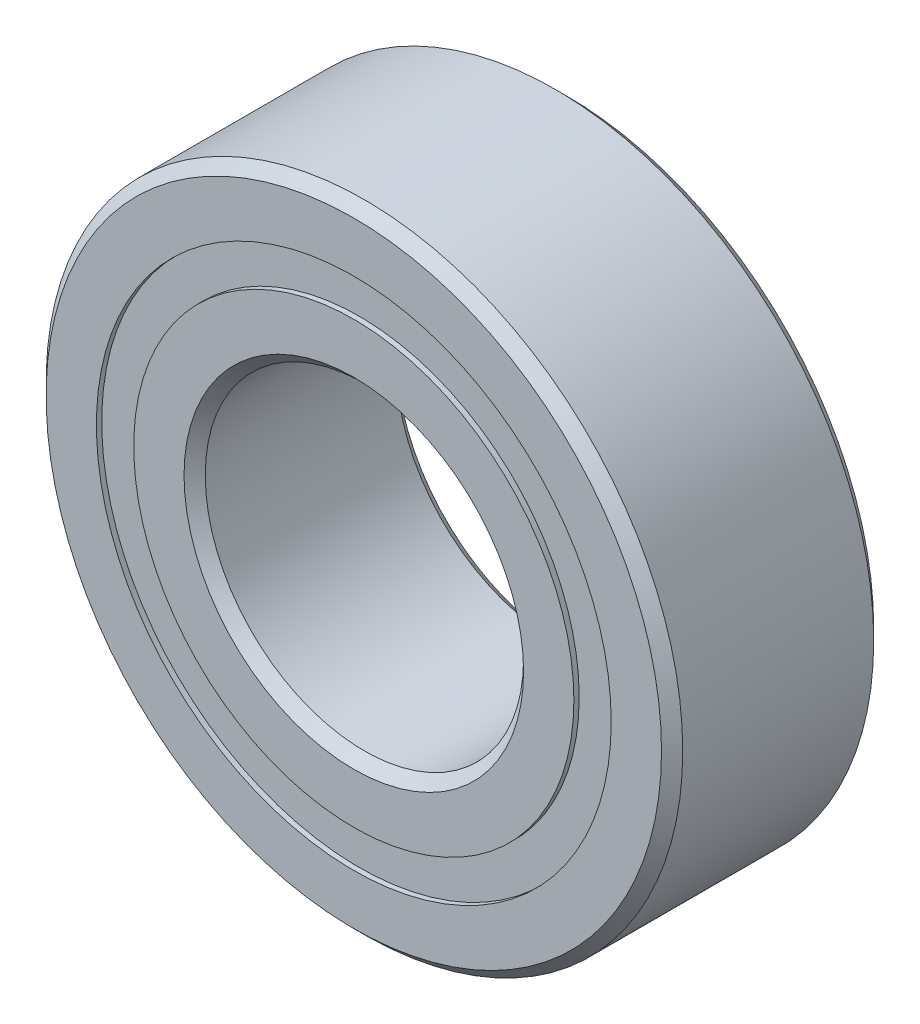
ISO-10303-21;
HEADER;
FILE_DESCRIPTION(('STEP AP214'),'2;1');
FILE_NAME('part.step','',(''),(''),'','','');
FILE_SCHEMA(('AUTOMOTIVE_DESIGN { 1 0 10303 214 1 1 1 1 }'));
ENDSEC;
DATA;
#1=APPLICATION_CONTEXT('core data for automotive mechanical design processes');
#2=APPLICATION_PROTOCOL_DEFINITION('international standard','automotive_design',2000,#1);
#3=PRODUCT_CONTEXT('',#1,'mechanical');
#4=PRODUCT('Part','Part','',(#3));
#5=PRODUCT_RELATED_PRODUCT_CATEGORY('part','',(#4));
#6=PRODUCT_DEFINITION_FORMATION('','',#4);
#7=PRODUCT_DEFINITION_CONTEXT('part definition',#1,'design');
#8=PRODUCT_DEFINITION('design','',#6,#7);
#9=PRODUCT_DEFINITION_SHAPE('','',#8);
#10=(LENGTH_UNIT() NAMED_UNIT(*) SI_UNIT(.MILLI.,.METRE.));
#11=(NAMED_UNIT(*) PLANE_ANGLE_UNIT() SI_UNIT($,.RADIAN.));
#12=(NAMED_UNIT(*) SI_UNIT($,.STERADIAN.) SOLID_ANGLE_UNIT());
#13=UNCERTAINTY_MEASURE_WITH_UNIT(LENGTH_MEASURE(1.E-05),#10,'distance_accuracy_value','');
#14=(GEOMETRIC_REPRESENTATION_CONTEXT(3) GLOBAL_UNCERTAINTY_ASSIGNED_CONTEXT((#13)) GLOBAL_UNIT_ASSIGNED_CONTEXT((#10,
#11,#12)) REPRESENTATION_CONTEXT('',''));
#15=CARTESIAN_POINT('',(0.,0.,0.));
#16=DIRECTION('',(0.,0.,1.));
#17=DIRECTION('',(1.,0.,0.));
#18=AXIS2_PLACEMENT_3D('',#15,#16,#17);
#19=CARTESIAN_POINT('',(0.,4.85164835164835,-1.9));
#20=DIRECTION('',(0.,0.,1.));
#21=DIRECTION('',(1.,0.,0.));
#22=AXIS2_PLACEMENT_3D('',#19,#20,#21);
#23=PLANE('',#22);
#24=CARTESIAN_POINT('',(0.,0.,-1.9));
#25=DIRECTION('',(0.,0.,1.));
#26=DIRECTION('',(1.,0.,0.));
#27=AXIS2_PLACEMENT_3D('',#24,#25,#26);
#28=CIRCLE('',#27,4.85164835164835);
#29=CARTESIAN_POINT('',(4.85164835164835,0.,-1.9));
#30=VERTEX_POINT('',#29);
#31=EDGE_CURVE('E69',#30,#30,#28,.T.);
#32=ORIENTED_EDGE('',*,*,#31,.F.);
#33=EDGE_LOOP('',(#32));
#34=FACE_BOUND('',#33,.T.);
#35=CARTESIAN_POINT('',(0.,0.,-1.9));
#36=DIRECTION('',(0.,0.,1.));
#37=DIRECTION('',(1.,0.,0.));
#38=AXIS2_PLACEMENT_3D('',#35,#36,#37);
#39=CIRCLE('',#38,4.14835164835165);
#40=CARTESIAN_POINT('',(4.14835164835165,0.,-1.9));
#41=VERTEX_POINT('',#40);
#42=EDGE_CURVE('E11',#41,#41,#39,.T.);
#43=ORIENTED_EDGE('',*,*,#42,.T.);
#44=EDGE_LOOP('',(#43));
#45=FACE_BOUND('',#44,.T.);
#46=ADVANCED_FACE('F50',(#34,#45),#23,.F.);
#47=CARTESIAN_POINT('',(0.,0.,2.));
#48=DIRECTION('',(0.,0.,1.));
#49=DIRECTION('',(1.,0.,0.));
#50=AXIS2_PLACEMENT_3D('',#47,#48,#49);
#51=CYLINDRICAL_SURFACE('',#50,4.14835164835165);
#52=ORIENTED_EDGE('',*,*,#42,.F.);
#53=EDGE_LOOP('',(#52));
#54=FACE_BOUND('',#53,.T.);
#55=CARTESIAN_POINT('',(0.,0.,-0.955918417024762));
#56=DIRECTION('',(0.,0.,1.));
#57=DIRECTION('',(1.,0.,0.));
#58=AXIS2_PLACEMENT_3D('',#55,#56,#57);
#59=CIRCLE('',#58,4.14835164835165);
#60=CARTESIAN_POINT('',(4.14835164835165,0.,-0.955918417024762));
#61=VERTEX_POINT('',#60);
#62=EDGE_CURVE('E57',#61,#61,#59,.T.);
#63=ORIENTED_EDGE('',*,*,#62,.T.);
#64=EDGE_LOOP('',(#63));
#65=FACE_BOUND('',#64,.T.);
#66=ADVANCED_FACE('F80',(#54,#65),#51,.F.);
#67=CARTESIAN_POINT('',(0.,4.85164835164835,-0.955918417024762));
#68=DIRECTION('',(0.,0.,-1.));
#69=DIRECTION('',(-1.,0.,0.));
#70=AXIS2_PLACEMENT_3D('',#67,#68,#69);
#71=PLANE('',#70);
#72=ORIENTED_EDGE('',*,*,#62,.F.);
#73=EDGE_LOOP('',(#72));
#74=FACE_BOUND('',#73,.T.);
#75=CARTESIAN_POINT('',(0.,0.,-0.955918417024762));
#76=DIRECTION('',(0.,0.,1.));
#77=DIRECTION('',(1.,0.,0.));
#78=AXIS2_PLACEMENT_3D('',#75,#76,#77);
#79=CIRCLE('',#78,4.85164835164835);
#80=CARTESIAN_POINT('',(4.85164835164835,0.,-0.955918417024762));
#81=VERTEX_POINT('',#80);
#82=EDGE_CURVE('E63',#81,#81,#79,.T.);
#83=ORIENTED_EDGE('',*,*,#82,.T.);
#84=EDGE_LOOP('',(#83));
#85=FACE_BOUND('',#84,.T.);
#86=ADVANCED_FACE('F84',(#74,#85),#71,.F.);
#87=CARTESIAN_POINT('',(0.,0.,2.));
#88=DIRECTION('',(0.,0.,1.));
#89=DIRECTION('',(1.,0.,0.));
#90=AXIS2_PLACEMENT_3D('',#87,#88,#89);
#91=CYLINDRICAL_SURFACE('',#90,4.85164835164835);
#92=ORIENTED_EDGE('',*,*,#82,.F.);
#93=EDGE_LOOP('',(#92));
#94=FACE_BOUND('',#93,.T.);
#95=ORIENTED_EDGE('',*,*,#31,.T.);
#96=EDGE_LOOP('',(#95));
#97=FACE_BOUND('',#96,.T.);
#98=ADVANCED_FACE('F77',(#94,#97),#91,.T.);
#99=CLOSED_SHELL('',(#46,#66,#86,#98));
#100=MANIFOLD_SOLID_BREP('B2',#99);
#101=CARTESIAN_POINT('',(0.,4.85164835164835,1.9));
#102=DIRECTION('',(0.,0.,-1.));
#103=DIRECTION('',(-1.,0.,0.));
#104=AXIS2_PLACEMENT_3D('',#101,#102,#103);
#105=PLANE('',#104);
#106=CARTESIAN_POINT('',(0.,0.,1.9));
#107=DIRECTION('',(0.,0.,1.));
#108=DIRECTION('',(1.,0.,0.));
#109=AXIS2_PLACEMENT_3D('',#106,#107,#108);
#110=CIRCLE('',#109,4.14835164835165);
#111=CARTESIAN_POINT('',(4.14835164835165,0.,1.9));
#112=VERTEX_POINT('',#111);
#113=EDGE_CURVE('E49',#112,#112,#110,.T.);
#114=ORIENTED_EDGE('',*,*,#113,.F.);
#115=EDGE_LOOP('',(#114));
#116=FACE_BOUND('',#115,.T.);
#117=CARTESIAN_POINT('',(0.,0.,1.9));
#118=DIRECTION('',(0.,0.,1.));
#119=DIRECTION('',(1.,0.,0.));
#120=AXIS2_PLACEMENT_3D('',#117,#118,#119);
#121=CIRCLE('',#120,4.85164835164835);
#122=CARTESIAN_POINT('',(4.85164835164835,0.,1.9));
#123=VERTEX_POINT('',#122);
#124=EDGE_CURVE('E145',#123,#123,#121,.T.);
#125=ORIENTED_EDGE('',*,*,#124,.T.);
#126=EDGE_LOOP('',(#125));
#127=FACE_BOUND('',#126,.T.);
#128=ADVANCED_FACE('F126',(#116,#127),#105,.F.);
#129=CARTESIAN_POINT('',(0.,0.,2.));
#130=DIRECTION('',(0.,0.,1.));
#131=DIRECTION('',(1.,0.,0.));
#132=AXIS2_PLACEMENT_3D('',#129,#130,#131);
#133=CYLINDRICAL_SURFACE('',#132,4.14835164835165);
#134=CARTESIAN_POINT('',(0.,0.,0.955918417024761));
#135=DIRECTION('',(0.,0.,1.));
#136=DIRECTION('',(1.,0.,0.));
#137=AXIS2_PLACEMENT_3D('',#134,#135,#136);
#138=CIRCLE('',#137,4.14835164835165);
#139=CARTESIAN_POINT('',(4.14835164835165,0.,0.955918417024761));
#140=VERTEX_POINT('',#139);
#141=EDGE_CURVE('E133',#140,#140,#138,.T.);
#142=ORIENTED_EDGE('',*,*,#141,.F.);
#143=EDGE_LOOP('',(#142));
#144=FACE_BOUND('',#143,.T.);
#145=ORIENTED_EDGE('',*,*,#113,.T.);
#146=EDGE_LOOP('',(#145));
#147=FACE_BOUND('',#146,.T.);
#148=ADVANCED_FACE('F162',(#144,#147),#133,.F.);
#149=CARTESIAN_POINT('',(0.,4.85164835164835,0.955918417024761));
#150=DIRECTION('',(0.,0.,1.));
#151=DIRECTION('',(1.,0.,0.));
#152=AXIS2_PLACEMENT_3D('',#149,#150,#151);
#153=PLANE('',#152);
#154=CARTESIAN_POINT('',(0.,0.,0.955918417024761));
#155=DIRECTION('',(0.,0.,1.));
#156=DIRECTION('',(1.,0.,0.));
#157=AXIS2_PLACEMENT_3D('',#154,#155,#156);
#158=CIRCLE('',#157,4.85164835164835);
#159=CARTESIAN_POINT('',(4.85164835164835,0.,0.955918417024761));
#160=VERTEX_POINT('',#159);
#161=EDGE_CURVE('E139',#160,#160,#158,.T.);
#162=ORIENTED_EDGE('',*,*,#161,.F.);
#163=EDGE_LOOP('',(#162));
#164=FACE_BOUND('',#163,.T.);
#165=ORIENTED_EDGE('',*,*,#141,.T.);
#166=EDGE_LOOP('',(#165));
#167=FACE_BOUND('',#166,.T.);
#168=ADVANCED_FACE('F157',(#164,#167),#153,.F.);
#169=CARTESIAN_POINT('',(0.,0.,2.));
#170=DIRECTION('',(0.,0.,1.));
#171=DIRECTION('',(1.,0.,0.));
#172=AXIS2_PLACEMENT_3D('',#169,#170,#171);
#173=CYLINDRICAL_SURFACE('',#172,4.85164835164835);
#174=ORIENTED_EDGE('',*,*,#124,.F.);
#175=EDGE_LOOP('',(#174));
#176=FACE_BOUND('',#175,.T.);
#177=ORIENTED_EDGE('',*,*,#161,.T.);
#178=EDGE_LOOP('',(#177));
#179=FACE_BOUND('',#178,.T.);
#180=ADVANCED_FACE('F154',(#176,#179),#173,.T.);
#181=CLOSED_SHELL('',(#128,#148,#168,#180));
#182=MANIFOLD_SOLID_BREP('B6',#181);
#183=CARTESIAN_POINT('',(-2.24999999999995,3.89711431703,0.));
#184=DIRECTION('',(0.,0.,1.));
#185=DIRECTION('',(-0.499999999999989,0.866025403784445,0.));
#186=AXIS2_PLACEMENT_3D('',#183,#184,#185);
#187=SPHERICAL_SURFACE('',#186,0.955918417024761);
#188=CARTESIAN_POINT('',(-2.24999999999995,3.89711431703,0.955918417024761));
#189=VERTEX_POINT('',#188);
#190=VERTEX_LOOP('',#189);
#191=FACE_BOUND('',#190,.T.);
#192=ADVANCED_FACE('F202',(#191),#187,.T.);
#193=CLOSED_SHELL('',(#192));
#194=MANIFOLD_SOLID_BREP('B44',#193);
#195=CARTESIAN_POINT('',(-3.89711431702995,2.25000000000005,0.));
#196=DIRECTION('',(0.,0.,1.));
#197=DIRECTION('',(-0.866025403784433,0.50000000000001,0.));
#198=AXIS2_PLACEMENT_3D('',#195,#196,#197);
#199=SPHERICAL_SURFACE('',#198,0.955918417024761);
#200=CARTESIAN_POINT('',(-3.89711431702995,2.25000000000005,0.955918417024761));
#201=VERTEX_POINT('',#200);
#202=VERTEX_LOOP('',#201);
#203=FACE_BOUND('',#202,.T.);
#204=ADVANCED_FACE('F223',(#203),#199,.T.);
#205=CLOSED_SHELL('',(#204));
#206=MANIFOLD_SOLID_BREP('B122',#205);
#207=CARTESIAN_POINT('',(-4.5,0.,0.));
#208=DIRECTION('',(0.,0.,1.));
#209=DIRECTION('',(-1.,0.,0.));
#210=AXIS2_PLACEMENT_3D('',#207,#208,#209);
#211=SPHERICAL_SURFACE('',#210,0.955918417024761);
#212=CARTESIAN_POINT('',(-4.5,0.,0.955918417024761));
#213=VERTEX_POINT('',#212);
#214=VERTEX_LOOP('',#213);
#215=FACE_BOUND('',#214,.T.);
#216=ADVANCED_FACE('F244',(#215),#211,.T.);
#217=CLOSED_SHELL('',(#216));
#218=MANIFOLD_SOLID_BREP('B198',#217);
#219=CARTESIAN_POINT('',(-3.89711431703,-2.24999999999996,0.));
#220=DIRECTION('',(0.,0.,1.));
#221=DIRECTION('',(-0.866025403784443,-0.499999999999992,0.));
#222=AXIS2_PLACEMENT_3D('',#219,#220,#221);
#223=SPHERICAL_SURFACE('',#222,0.955918417024761);
#224=CARTESIAN_POINT('',(-3.89711431703,-2.24999999999996,0.955918417024761));
#225=VERTEX_POINT('',#224);
#226=VERTEX_LOOP('',#225);
#227=FACE_BOUND('',#226,.T.);
#228=ADVANCED_FACE('F265',(#227),#223,.T.);
#229=CLOSED_SHELL('',(#228));
#230=MANIFOLD_SOLID_BREP('B219',#229);
#231=CARTESIAN_POINT('',(-2.25000000000003,-3.89711431702996,0.));
#232=DIRECTION('',(0.,0.,1.));
#233=DIRECTION('',(-0.500000000000007,-0.866025403784435,0.));
#234=AXIS2_PLACEMENT_3D('',#231,#232,#233);
#235=SPHERICAL_SURFACE('',#234,0.955918417024761);
#236=CARTESIAN_POINT('',(-2.25000000000003,-3.89711431702996,0.955918417024761));
#237=VERTEX_POINT('',#236);
#238=VERTEX_LOOP('',#237);
#239=FACE_BOUND('',#238,.T.);
#240=ADVANCED_FACE('F286',(#239),#235,.T.);
#241=CLOSED_SHELL('',(#240));
#242=MANIFOLD_SOLID_BREP('B240',#241);
#243=CARTESIAN_POINT('',(0.,-4.5,0.));
#244=DIRECTION('',(0.,0.,1.));
#245=DIRECTION('',(0.,-1.,0.));
#246=AXIS2_PLACEMENT_3D('',#243,#244,#245);
#247=SPHERICAL_SURFACE('',#246,0.955918417024761);
#248=CARTESIAN_POINT('',(0.,-4.5,0.955918417024761));
#249=VERTEX_POINT('',#248);
#250=VERTEX_LOOP('',#249);
#251=FACE_BOUND('',#250,.T.);
#252=ADVANCED_FACE('F307',(#251),#247,.T.);
#253=CLOSED_SHELL('',(#252));
#254=MANIFOLD_SOLID_BREP('B261',#253);
#255=CARTESIAN_POINT('',(2.24999999999998,-3.89711431702999,0.));
#256=DIRECTION('',(0.,0.,1.));
#257=DIRECTION('',(0.499999999999995,-0.866025403784442,0.));
#258=AXIS2_PLACEMENT_3D('',#255,#256,#257);
#259=SPHERICAL_SURFACE('',#258,0.955918417024761);
#260=CARTESIAN_POINT('',(2.24999999999998,-3.89711431702999,0.955918417024761));
#261=VERTEX_POINT('',#260);
#262=VERTEX_LOOP('',#261);
#263=FACE_BOUND('',#262,.T.);
#264=ADVANCED_FACE('F328',(#263),#259,.T.);
#265=CLOSED_SHELL('',(#264));
#266=MANIFOLD_SOLID_BREP('B282',#265);
#267=CARTESIAN_POINT('',(3.89711431702996,-2.25000000000002,0.));
#268=DIRECTION('',(0.,0.,1.));
#269=DIRECTION('',(0.866025403784436,-0.500000000000004,0.));
#270=AXIS2_PLACEMENT_3D('',#267,#268,#269);
#271=SPHERICAL_SURFACE('',#270,0.955918417024761);
#272=CARTESIAN_POINT('',(3.89711431702996,-2.25000000000002,0.955918417024761));
#273=VERTEX_POINT('',#272);
#274=VERTEX_LOOP('',#273);
#275=FACE_BOUND('',#274,.T.);
#276=ADVANCED_FACE('F349',(#275),#271,.T.);
#277=CLOSED_SHELL('',(#276));
#278=MANIFOLD_SOLID_BREP('B303',#277);
#279=CARTESIAN_POINT('',(4.5,0.,0.));
#280=DIRECTION('',(0.,0.,1.));
#281=DIRECTION('',(1.,0.,0.));
#282=AXIS2_PLACEMENT_3D('',#279,#280,#281);
#283=SPHERICAL_SURFACE('',#282,0.955918417024761);
#284=CARTESIAN_POINT('',(4.5,0.,0.955918417024761));
#285=VERTEX_POINT('',#284);
#286=VERTEX_LOOP('',#285);
#287=FACE_BOUND('',#286,.T.);
#288=ADVANCED_FACE('F370',(#287),#283,.T.);
#289=CLOSED_SHELL('',(#288));
#290=MANIFOLD_SOLID_BREP('B324',#289);
#291=CARTESIAN_POINT('',(3.89711431702998,2.24999999999999,0.));
#292=DIRECTION('',(0.,0.,1.));
#293=DIRECTION('',(0.86602540378444,0.499999999999998,0.));
#294=AXIS2_PLACEMENT_3D('',#291,#292,#293);
#295=SPHERICAL_SURFACE('',#294,0.955918417024761);
#296=CARTESIAN_POINT('',(3.89711431702998,2.24999999999999,0.955918417024761));
#297=VERTEX_POINT('',#296);
#298=VERTEX_LOOP('',#297);
#299=FACE_BOUND('',#298,.T.);
#300=ADVANCED_FACE('F391',(#299),#295,.T.);
#301=CLOSED_SHELL('',(#300));
#302=MANIFOLD_SOLID_BREP('B345',#301);
#303=CARTESIAN_POINT('',(2.25,3.89711431702997,0.));
#304=DIRECTION('',(0.,0.,1.));
#305=DIRECTION('',(0.500000000000001,0.866025403784438,0.));
#306=AXIS2_PLACEMENT_3D('',#303,#304,#305);
#307=SPHERICAL_SURFACE('',#306,0.955918417024761);
#308=CARTESIAN_POINT('',(2.25,3.89711431702997,0.955918417024761));
#309=VERTEX_POINT('',#308);
#310=VERTEX_LOOP('',#309);
#311=FACE_BOUND('',#310,.T.);
#312=ADVANCED_FACE('F412',(#311),#307,.T.);
#313=CLOSED_SHELL('',(#312));
#314=MANIFOLD_SOLID_BREP('B366',#313);
#315=CARTESIAN_POINT('',(0.,4.5,0.));
#316=DIRECTION('',(0.,0.,1.));
#317=DIRECTION('',(0.,1.,0.));
#318=AXIS2_PLACEMENT_3D('',#315,#316,#317);
#319=SPHERICAL_SURFACE('',#318,0.955918417024761);
#320=CARTESIAN_POINT('',(0.,4.5,0.955918417024761));
#321=VERTEX_POINT('',#320);
#322=VERTEX_LOOP('',#321);
#323=FACE_BOUND('',#322,.T.);
#324=ADVANCED_FACE('F435',(#323),#319,.T.);
#325=CLOSED_SHELL('',(#324));
#326=MANIFOLD_SOLID_BREP('B387',#325);
#327=CARTESIAN_POINT('',(0.,4.14835164835165,2.));
#328=DIRECTION('',(0.,0.,-1.));
#329=DIRECTION('',(-1.,0.,0.));
#330=AXIS2_PLACEMENT_3D('',#327,#328,#329);
#331=PLANE('',#330);
#332=CARTESIAN_POINT('',(0.,0.,2.));
#333=DIRECTION('',(0.,0.,1.));
#334=DIRECTION('',(1.,0.,0.));
#335=AXIS2_PLACEMENT_3D('',#332,#333,#334);
#336=CIRCLE('',#335,3.2);
#337=CARTESIAN_POINT('',(3.2,0.,2.));
#338=VERTEX_POINT('',#337);
#339=EDGE_CURVE('E492',#338,#338,#336,.T.);
#340=ORIENTED_EDGE('',*,*,#339,.F.);
#341=EDGE_LOOP('',(#340));
#342=FACE_BOUND('',#341,.T.);
#343=CARTESIAN_POINT('',(0.,0.,2.));
#344=DIRECTION('',(0.,0.,1.));
#345=DIRECTION('',(1.,0.,0.));
#346=AXIS2_PLACEMENT_3D('',#343,#344,#345);
#347=CIRCLE('',#346,4.14835164835165);
#348=CARTESIAN_POINT('',(4.14835164835165,0.,2.));
#349=VERTEX_POINT('',#348);
#350=EDGE_CURVE('E434',#349,#349,#347,.T.);
#351=ORIENTED_EDGE('',*,*,#350,.T.);
#352=EDGE_LOOP('',(#351));
#353=FACE_BOUND('',#352,.T.);
#354=ADVANCED_FACE('F455',(#342,#353),#331,.F.);
#355=CARTESIAN_POINT('',(0.,0.,2.));
#356=DIRECTION('',(0.,0.,1.));
#357=DIRECTION('',(1.,0.,0.));
#358=AXIS2_PLACEMENT_3D('',#355,#356,#357);
#359=CYLINDRICAL_SURFACE('',#358,4.14835164835165);
#360=ORIENTED_EDGE('',*,*,#350,.F.);
#361=EDGE_LOOP('',(#360));
#362=FACE_BOUND('',#361,.T.);
#363=CARTESIAN_POINT('',(0.,0.,0.888888888888889));
#364=DIRECTION('',(0.,0.,1.));
#365=DIRECTION('',(1.,0.,0.));
#366=AXIS2_PLACEMENT_3D('',#363,#364,#365);
#367=CIRCLE('',#366,4.14835164835165);
#368=CARTESIAN_POINT('',(4.14835164835165,0.,0.888888888888889));
#369=VERTEX_POINT('',#368);
#370=EDGE_CURVE('E462',#369,#369,#367,.T.);
#371=ORIENTED_EDGE('',*,*,#370,.T.);
#372=EDGE_LOOP('',(#371));
#373=FACE_BOUND('',#372,.T.);
#374=ADVANCED_FACE('F501',(#362,#373),#359,.T.);
#375=CARTESIAN_POINT('',(0.,0.,0.));
#376=DIRECTION('',(0.,0.,1.));
#377=DIRECTION('',(1.,0.,0.));
#378=AXIS2_PLACEMENT_3D('',#375,#376,#377);
#379=TOROIDAL_SURFACE('',#378,4.49999999999999,0.95591841702476);
#380=ORIENTED_EDGE('',*,*,#370,.F.);
#381=EDGE_LOOP('',(#380));
#382=FACE_BOUND('',#381,.T.);
#383=CARTESIAN_POINT('',(0.,0.,-0.88888888888889));
#384=DIRECTION('',(0.,0.,1.));
#385=DIRECTION('',(1.,0.,0.));
#386=AXIS2_PLACEMENT_3D('',#383,#384,#385);
#387=CIRCLE('',#386,4.14835164835165);
#388=CARTESIAN_POINT('',(4.14835164835165,0.,-0.88888888888889));
#389=VERTEX_POINT('',#388);
#390=EDGE_CURVE('E468',#389,#389,#387,.T.);
#391=ORIENTED_EDGE('',*,*,#390,.T.);
#392=EDGE_LOOP('',(#391));
#393=FACE_BOUND('',#392,.T.);
#394=ADVANCED_FACE('F505',(#382,#393),#379,.F.);
#395=CARTESIAN_POINT('',(0.,0.,2.));
#396=DIRECTION('',(0.,0.,1.));
#397=DIRECTION('',(1.,0.,0.));
#398=AXIS2_PLACEMENT_3D('',#395,#396,#397);
#399=CYLINDRICAL_SURFACE('',#398,4.14835164835165);
#400=ORIENTED_EDGE('',*,*,#390,.F.);
#401=EDGE_LOOP('',(#400));
#402=FACE_BOUND('',#401,.T.);
#403=CARTESIAN_POINT('',(0.,0.,-2.));
#404=DIRECTION('',(0.,0.,1.));
#405=DIRECTION('',(1.,0.,0.));
#406=AXIS2_PLACEMENT_3D('',#403,#404,#405);
#407=CIRCLE('',#406,4.14835164835165);
#408=CARTESIAN_POINT('',(4.14835164835165,0.,-2.));
#409=VERTEX_POINT('',#408);
#410=EDGE_CURVE('E474',#409,#409,#407,.T.);
#411=ORIENTED_EDGE('',*,*,#410,.T.);
#412=EDGE_LOOP('',(#411));
#413=FACE_BOUND('',#412,.T.);
#414=ADVANCED_FACE('F510',(#402,#413),#399,.T.);
#415=CARTESIAN_POINT('',(0.,3.2,-2.));
#416=DIRECTION('',(0.,0.,1.));
#417=DIRECTION('',(1.,0.,0.));
#418=AXIS2_PLACEMENT_3D('',#415,#416,#417);
#419=PLANE('',#418);
#420=ORIENTED_EDGE('',*,*,#410,.F.);
#421=EDGE_LOOP('',(#420));
#422=FACE_BOUND('',#421,.T.);
#423=CARTESIAN_POINT('',(0.,0.,-2.));
#424=DIRECTION('',(0.,0.,1.));
#425=DIRECTION('',(1.,0.,0.));
#426=AXIS2_PLACEMENT_3D('',#423,#424,#425);
#427=CIRCLE('',#426,3.2);
#428=CARTESIAN_POINT('',(3.2,0.,-2.));
#429=VERTEX_POINT('',#428);
#430=EDGE_CURVE('E480',#429,#429,#427,.T.);
#431=ORIENTED_EDGE('',*,*,#430,.T.);
#432=EDGE_LOOP('',(#431));
#433=FACE_BOUND('',#432,.T.);
#434=ADVANCED_FACE('F516',(#422,#433),#419,.F.);
#435=CARTESIAN_POINT('',(0.,0.,-1.8));
#436=DIRECTION('',(0.,0.,-1.));
#437=DIRECTION('',(-1.,0.,0.));
#438=AXIS2_PLACEMENT_3D('',#435,#436,#437);
#439=CONICAL_SURFACE('',#438,3.,0.785398163397454);
#440=ORIENTED_EDGE('',*,*,#430,.F.);
#441=EDGE_LOOP('',(#440));
#442=FACE_BOUND('',#441,.T.);
#443=CARTESIAN_POINT('',(0.,0.,-1.8));
#444=DIRECTION('',(0.,0.,1.));
#445=DIRECTION('',(1.,0.,0.));
#446=AXIS2_PLACEMENT_3D('',#443,#444,#445);
#447=CIRCLE('',#446,3.);
#448=CARTESIAN_POINT('',(3.,0.,-1.8));
#449=VERTEX_POINT('',#448);
#450=EDGE_CURVE('E484',#449,#449,#447,.T.);
#451=ORIENTED_EDGE('',*,*,#450,.T.);
#452=EDGE_LOOP('',(#451));
#453=FACE_BOUND('',#452,.T.);
#454=ADVANCED_FACE('F520',(#442,#453),#439,.F.);
#455=CARTESIAN_POINT('',(0.,0.,2.));
#456=DIRECTION('',(0.,0.,1.));
#457=DIRECTION('',(1.,0.,0.));
#458=AXIS2_PLACEMENT_3D('',#455,#456,#457);
#459=CYLINDRICAL_SURFACE('',#458,3.);
#460=ORIENTED_EDGE('',*,*,#450,.F.);
#461=EDGE_LOOP('',(#460));
#462=FACE_BOUND('',#461,.T.);
#463=CARTESIAN_POINT('',(0.,0.,1.8));
#464=DIRECTION('',(0.,0.,1.));
#465=DIRECTION('',(1.,0.,0.));
#466=AXIS2_PLACEMENT_3D('',#463,#464,#465);
#467=CIRCLE('',#466,3.);
#468=CARTESIAN_POINT('',(3.,0.,1.8));
#469=VERTEX_POINT('',#468);
#470=EDGE_CURVE('E488',#469,#469,#467,.T.);
#471=ORIENTED_EDGE('',*,*,#470,.T.);
#472=EDGE_LOOP('',(#471));
#473=FACE_BOUND('',#472,.T.);
#474=ADVANCED_FACE('F524',(#462,#473),#459,.F.);
#475=CARTESIAN_POINT('',(0.,0.,2.));
#476=DIRECTION('',(0.,0.,1.));
#477=DIRECTION('',(1.,0.,0.));
#478=AXIS2_PLACEMENT_3D('',#475,#476,#477);
#479=CONICAL_SURFACE('',#478,3.2,0.785398163397442);
#480=ORIENTED_EDGE('',*,*,#470,.F.);
#481=EDGE_LOOP('',(#480));
#482=FACE_BOUND('',#481,.T.);
#483=ORIENTED_EDGE('',*,*,#339,.T.);
#484=EDGE_LOOP('',(#483));
#485=FACE_BOUND('',#484,.T.);
#486=ADVANCED_FACE('F498',(#482,#485),#479,.F.);
#487=CLOSED_SHELL('',(#354,#374,#394,#414,#434,#454,#474,#486));
#488=MANIFOLD_SOLID_BREP('B408',#487);
#489=CARTESIAN_POINT('',(0.,0.,1.8));
#490=DIRECTION('',(0.,0.,-1.));
#491=DIRECTION('',(-1.,0.,0.));
#492=AXIS2_PLACEMENT_3D('',#489,#490,#491);
#493=CONICAL_SURFACE('',#492,6.,0.78539816339745);
#494=CARTESIAN_POINT('',(0.,0.,2.));
#495=DIRECTION('',(0.,0.,1.));
#496=DIRECTION('',(1.,0.,0.));
#497=AXIS2_PLACEMENT_3D('',#494,#495,#496);
#498=CIRCLE('',#497,5.8);
#499=CARTESIAN_POINT('',(5.8,0.,2.));
#500=VERTEX_POINT('',#499);
#501=EDGE_CURVE('E630',#500,#500,#498,.T.);
#502=ORIENTED_EDGE('',*,*,#501,.F.);
#503=EDGE_LOOP('',(#502));
#504=FACE_BOUND('',#503,.T.);
#505=CARTESIAN_POINT('',(0.,0.,1.8));
#506=DIRECTION('',(0.,0.,1.));
#507=DIRECTION('',(1.,0.,0.));
#508=AXIS2_PLACEMENT_3D('',#505,#506,#507);
#509=CIRCLE('',#508,6.);
#510=CARTESIAN_POINT('',(6.,0.,1.8));
#511=VERTEX_POINT('',#510);
#512=EDGE_CURVE('E454',#511,#511,#509,.T.);
#513=ORIENTED_EDGE('',*,*,#512,.T.);
#514=EDGE_LOOP('',(#513));
#515=FACE_BOUND('',#514,.T.);
#516=ADVANCED_FACE('F593',(#504,#515),#493,.T.);
#517=CARTESIAN_POINT('',(0.,0.,2.));
#518=DIRECTION('',(0.,0.,1.));
#519=DIRECTION('',(1.,0.,0.));
#520=AXIS2_PLACEMENT_3D('',#517,#518,#519);
#521=CYLINDRICAL_SURFACE('',#520,6.);
#522=ORIENTED_EDGE('',*,*,#512,.F.);
#523=EDGE_LOOP('',(#522));
#524=FACE_BOUND('',#523,.T.);
#525=CARTESIAN_POINT('',(0.,0.,-1.8));
#526=DIRECTION('',(0.,0.,1.));
#527=DIRECTION('',(1.,0.,0.));
#528=AXIS2_PLACEMENT_3D('',#525,#526,#527);
#529=CIRCLE('',#528,6.);
#530=CARTESIAN_POINT('',(6.,0.,-1.8));
#531=VERTEX_POINT('',#530);
#532=EDGE_CURVE('E600',#531,#531,#529,.T.);
#533=ORIENTED_EDGE('',*,*,#532,.T.);
#534=EDGE_LOOP('',(#533));
#535=FACE_BOUND('',#534,.T.);
#536=ADVANCED_FACE('F639',(#524,#535),#521,.T.);
#537=CARTESIAN_POINT('',(0.,0.,-2.));
#538=DIRECTION('',(0.,0.,1.));
#539=DIRECTION('',(1.,0.,0.));
#540=AXIS2_PLACEMENT_3D('',#537,#538,#539);
#541=CONICAL_SURFACE('',#540,5.8,0.78539816339745);
#542=ORIENTED_EDGE('',*,*,#532,.F.);
#543=EDGE_LOOP('',(#542));
#544=FACE_BOUND('',#543,.T.);
#545=CARTESIAN_POINT('',(0.,0.,-2.));
#546=DIRECTION('',(0.,0.,1.));
#547=DIRECTION('',(1.,0.,0.));
#548=AXIS2_PLACEMENT_3D('',#545,#546,#547);
#549=CIRCLE('',#548,5.8);
#550=CARTESIAN_POINT('',(5.8,0.,-2.));
#551=VERTEX_POINT('',#550);
#552=EDGE_CURVE('E606',#551,#551,#549,.T.);
#553=ORIENTED_EDGE('',*,*,#552,.T.);
#554=EDGE_LOOP('',(#553));
#555=FACE_BOUND('',#554,.T.);
#556=ADVANCED_FACE('F643',(#544,#555),#541,.T.);
#557=CARTESIAN_POINT('',(0.,5.8,-2.));
#558=DIRECTION('',(0.,0.,1.));
#559=DIRECTION('',(1.,0.,0.));
#560=AXIS2_PLACEMENT_3D('',#557,#558,#559);
#561=PLANE('',#560);
#562=ORIENTED_EDGE('',*,*,#552,.F.);
#563=EDGE_LOOP('',(#562));
#564=FACE_BOUND('',#563,.T.);
#565=CARTESIAN_POINT('',(0.,0.,-2.));
#566=DIRECTION('',(0.,0.,1.));
#567=DIRECTION('',(1.,0.,0.));
#568=AXIS2_PLACEMENT_3D('',#565,#566,#567);
#569=CIRCLE('',#568,4.85164835164835);
#570=CARTESIAN_POINT('',(4.85164835164835,0.,-2.));
#571=VERTEX_POINT('',#570);
#572=EDGE_CURVE('E612',#571,#571,#569,.T.);
#573=ORIENTED_EDGE('',*,*,#572,.T.);
#574=EDGE_LOOP('',(#573));
#575=FACE_BOUND('',#574,.T.);
#576=ADVANCED_FACE('F648',(#564,#575),#561,.F.);
#577=CARTESIAN_POINT('',(0.,0.,2.));
#578=DIRECTION('',(0.,0.,1.));
#579=DIRECTION('',(1.,0.,0.));
#580=AXIS2_PLACEMENT_3D('',#577,#578,#579);
#581=CYLINDRICAL_SURFACE('',#580,4.85164835164835);
#582=ORIENTED_EDGE('',*,*,#572,.F.);
#583=EDGE_LOOP('',(#582));
#584=FACE_BOUND('',#583,.T.);
#585=CARTESIAN_POINT('',(0.,0.,-0.888888888888889));
#586=DIRECTION('',(0.,0.,1.));
#587=DIRECTION('',(1.,0.,0.));
#588=AXIS2_PLACEMENT_3D('',#585,#586,#587);
#589=CIRCLE('',#588,4.85164835164835);
#590=CARTESIAN_POINT('',(4.85164835164835,0.,-0.888888888888889));
#591=VERTEX_POINT('',#590);
#592=EDGE_CURVE('E618',#591,#591,#589,.T.);
#593=ORIENTED_EDGE('',*,*,#592,.T.);
#594=EDGE_LOOP('',(#593));
#595=FACE_BOUND('',#594,.T.);
#596=ADVANCED_FACE('F654',(#584,#595),#581,.F.);
#597=CARTESIAN_POINT('',(0.,0.,0.));
#598=DIRECTION('',(0.,0.,1.));
#599=DIRECTION('',(1.,0.,0.));
#600=AXIS2_PLACEMENT_3D('',#597,#598,#599);
#601=TOROIDAL_SURFACE('',#600,4.5,0.955918417024761);
#602=ORIENTED_EDGE('',*,*,#592,.F.);
#603=EDGE_LOOP('',(#602));
#604=FACE_BOUND('',#603,.T.);
#605=CARTESIAN_POINT('',(0.,0.,0.888888888888889));
#606=DIRECTION('',(0.,0.,1.));
#607=DIRECTION('',(1.,0.,0.));
#608=AXIS2_PLACEMENT_3D('',#605,#606,#607);
#609=CIRCLE('',#608,4.85164835164835);
#610=CARTESIAN_POINT('',(4.85164835164835,0.,0.888888888888889));
#611=VERTEX_POINT('',#610);
#612=EDGE_CURVE('E622',#611,#611,#609,.T.);
#613=ORIENTED_EDGE('',*,*,#612,.T.);
#614=EDGE_LOOP('',(#613));
#615=FACE_BOUND('',#614,.T.);
#616=ADVANCED_FACE('F658',(#604,#615),#601,.F.);
#617=CARTESIAN_POINT('',(0.,0.,2.));
#618=DIRECTION('',(0.,0.,1.));
#619=DIRECTION('',(1.,0.,0.));
#620=AXIS2_PLACEMENT_3D('',#617,#618,#619);
#621=CYLINDRICAL_SURFACE('',#620,4.85164835164835);
#622=ORIENTED_EDGE('',*,*,#612,.F.);
#623=EDGE_LOOP('',(#622));
#624=FACE_BOUND('',#623,.T.);
#625=CARTESIAN_POINT('',(0.,0.,2.));
#626=DIRECTION('',(0.,0.,1.));
#627=DIRECTION('',(1.,0.,0.));
#628=AXIS2_PLACEMENT_3D('',#625,#626,#627);
#629=CIRCLE('',#628,4.85164835164835);
#630=CARTESIAN_POINT('',(4.85164835164835,0.,2.));
#631=VERTEX_POINT('',#630);
#632=EDGE_CURVE('E626',#631,#631,#629,.T.);
#633=ORIENTED_EDGE('',*,*,#632,.T.);
#634=EDGE_LOOP('',(#633));
#635=FACE_BOUND('',#634,.T.);
#636=ADVANCED_FACE('F662',(#624,#635),#621,.F.);
#637=CARTESIAN_POINT('',(0.,5.8,2.));
#638=DIRECTION('',(0.,0.,-1.));
#639=DIRECTION('',(-1.,0.,0.));
#640=AXIS2_PLACEMENT_3D('',#637,#638,#639);
#641=PLANE('',#640);
#642=ORIENTED_EDGE('',*,*,#632,.F.);
#643=EDGE_LOOP('',(#642));
#644=FACE_BOUND('',#643,.T.);
#645=ORIENTED_EDGE('',*,*,#501,.T.);
#646=EDGE_LOOP('',(#645));
#647=FACE_BOUND('',#646,.T.);
#648=ADVANCED_FACE('F636',(#644,#647),#641,.F.);
#649=CLOSED_SHELL('',(#516,#536,#556,#576,#596,#616,#636,#648));
#650=MANIFOLD_SOLID_BREP('B429',#649);
#651=ADVANCED_BREP_SHAPE_REPRESENTATION('',(#18,#100,#182,#194,#206,#218,#230,#242,#254,#266,
#278,#290,#302,#314,#326,#488,#650),#14);
#652=SHAPE_DEFINITION_REPRESENTATION(#9,#651);
ENDSEC;
END-ISO-10303-21;
